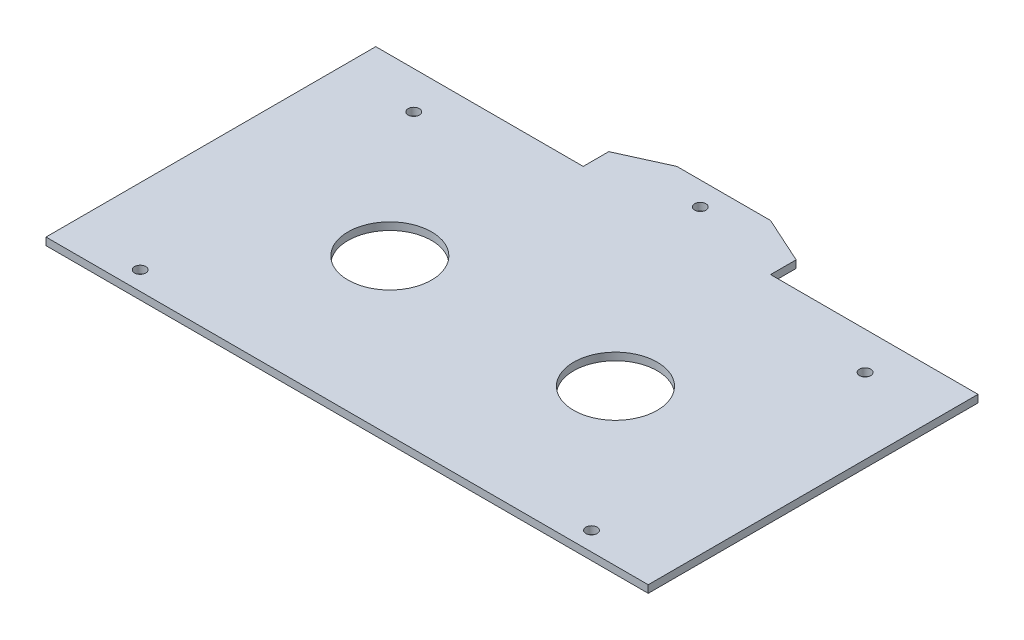
ISO-10303-21;
HEADER;
FILE_DESCRIPTION(('STEP AP214'),'2;1');
FILE_NAME('part.step','',(''),(''),'','','');
FILE_SCHEMA(('AUTOMOTIVE_DESIGN { 1 0 10303 214 1 1 1 1 }'));
ENDSEC;
DATA;
#1=APPLICATION_CONTEXT('core data for automotive mechanical design processes');
#2=APPLICATION_PROTOCOL_DEFINITION('international standard','automotive_design',2000,#1);
#3=PRODUCT_CONTEXT('',#1,'mechanical');
#4=PRODUCT('Part','Part','',(#3));
#5=PRODUCT_RELATED_PRODUCT_CATEGORY('part','',(#4));
#6=PRODUCT_DEFINITION_FORMATION('','',#4);
#7=PRODUCT_DEFINITION_CONTEXT('part definition',#1,'design');
#8=PRODUCT_DEFINITION('design','',#6,#7);
#9=PRODUCT_DEFINITION_SHAPE('','',#8);
#10=(LENGTH_UNIT() NAMED_UNIT(*) SI_UNIT(.MILLI.,.METRE.));
#11=(NAMED_UNIT(*) PLANE_ANGLE_UNIT() SI_UNIT($,.RADIAN.));
#12=(NAMED_UNIT(*) SI_UNIT($,.STERADIAN.) SOLID_ANGLE_UNIT());
#13=UNCERTAINTY_MEASURE_WITH_UNIT(LENGTH_MEASURE(1.E-05),#10,'distance_accuracy_value','');
#14=(GEOMETRIC_REPRESENTATION_CONTEXT(3) GLOBAL_UNCERTAINTY_ASSIGNED_CONTEXT((#13)) GLOBAL_UNIT_ASSIGNED_CONTEXT((#10,
#11,#12)) REPRESENTATION_CONTEXT('',''));
#15=CARTESIAN_POINT('',(0.,0.,0.));
#16=DIRECTION('',(0.,0.,1.));
#17=DIRECTION('',(1.,0.,0.));
#18=AXIS2_PLACEMENT_3D('',#15,#16,#17);
#19=CARTESIAN_POINT('',(0.,2.,-44.));
#20=DIRECTION('',(0.,0.,1.));
#21=DIRECTION('',(1.,0.,0.));
#22=AXIS2_PLACEMENT_3D('',#19,#20,#21);
#23=PLANE('',#22);
#24=DIRECTION('',(0.,1.,0.));
#25=VECTOR('',#24,1.);
#26=CARTESIAN_POINT('',(-79.1797078460986,-64.4999999999999,-44.));
#27=LINE('',#26,#25);
#28=CARTESIAN_POINT('',(-79.1797078460986,0.,-44.));
#29=VERTEX_POINT('',#28);
#30=CARTESIAN_POINT('',(-79.1797078460986,2.,-44.));
#31=VERTEX_POINT('',#30);
#32=EDGE_CURVE('E59',#29,#31,#27,.T.);
#33=ORIENTED_EDGE('',*,*,#32,.T.);
#34=DIRECTION('',(-1.,0.,0.));
#35=VECTOR('',#34,1.);
#36=CARTESIAN_POINT('',(0.,2.,-44.));
#37=LINE('',#36,#35);
#38=CARTESIAN_POINT('',(-23.8283042472908,2.,-44.));
#39=VERTEX_POINT('',#38);
#40=EDGE_CURVE('E141',#39,#31,#37,.T.);
#41=ORIENTED_EDGE('',*,*,#40,.F.);
#42=DIRECTION('',(0.,1.,0.));
#43=VECTOR('',#42,1.);
#44=CARTESIAN_POINT('',(-23.8283042472908,-51.5375899441171,-44.));
#45=LINE('',#44,#43);
#46=CARTESIAN_POINT('',(-23.8283042472908,0.,-44.));
#47=VERTEX_POINT('',#46);
#48=EDGE_CURVE('E207',#47,#39,#45,.T.);
#49=ORIENTED_EDGE('',*,*,#48,.F.);
#50=DIRECTION('',(-1.,0.,0.));
#51=VECTOR('',#50,1.);
#52=CARTESIAN_POINT('',(0.,0.,-44.));
#53=LINE('',#52,#51);
#54=EDGE_CURVE('E165',#47,#29,#53,.T.);
#55=ORIENTED_EDGE('',*,*,#54,.T.);
#56=EDGE_LOOP('',(#33,#41,#49,#55));
#57=FACE_BOUND('',#56,.T.);
#58=ADVANCED_FACE('F44',(#57),#23,.F.);
#59=CARTESIAN_POINT('',(0.,2.,44.));
#60=DIRECTION('',(0.,0.,-1.));
#61=DIRECTION('',(-1.,0.,0.));
#62=AXIS2_PLACEMENT_3D('',#59,#60,#61);
#63=PLANE('',#62);
#64=DIRECTION('',(1.,0.,0.));
#65=VECTOR('',#64,1.);
#66=CARTESIAN_POINT('',(0.,0.,44.));
#67=LINE('',#66,#65);
#68=CARTESIAN_POINT('',(-79.1797078460986,0.,44.));
#69=VERTEX_POINT('',#68);
#70=CARTESIAN_POINT('',(81.523099351517,0.,44.));
#71=VERTEX_POINT('',#70);
#72=EDGE_CURVE('E164',#69,#71,#67,.T.);
#73=ORIENTED_EDGE('',*,*,#72,.T.);
#74=DIRECTION('',(0.,1.,0.));
#75=VECTOR('',#74,1.);
#76=CARTESIAN_POINT('',(81.523099351517,-64.4999999999999,44.));
#77=LINE('',#76,#75);
#78=CARTESIAN_POINT('',(81.523099351517,2.,44.));
#79=VERTEX_POINT('',#78);
#80=EDGE_CURVE('E67',#71,#79,#77,.T.);
#81=ORIENTED_EDGE('',*,*,#80,.T.);
#82=DIRECTION('',(1.,0.,0.));
#83=VECTOR('',#82,1.);
#84=CARTESIAN_POINT('',(0.,2.,44.));
#85=LINE('',#84,#83);
#86=CARTESIAN_POINT('',(-79.1797078460986,2.,44.));
#87=VERTEX_POINT('',#86);
#88=EDGE_CURVE('E135',#87,#79,#85,.T.);
#89=ORIENTED_EDGE('',*,*,#88,.F.);
#90=DIRECTION('',(0.,1.,0.));
#91=VECTOR('',#90,1.);
#92=CARTESIAN_POINT('',(-79.1797078460986,-64.4999999999999,44.));
#93=LINE('',#92,#91);
#94=EDGE_CURVE('E136',#69,#87,#93,.T.);
#95=ORIENTED_EDGE('',*,*,#94,.F.);
#96=EDGE_LOOP('',(#73,#81,#89,#95));
#97=FACE_BOUND('',#96,.T.);
#98=ADVANCED_FACE('F192',(#97),#63,.F.);
#99=CARTESIAN_POINT('',(0.,2.,0.));
#100=DIRECTION('',(0.,1.,0.));
#101=DIRECTION('',(0.,0.,1.));
#102=AXIS2_PLACEMENT_3D('',#99,#100,#101);
#103=PLANE('',#102);
#104=DIRECTION('',(0.,0.,1.));
#105=VECTOR('',#104,1.);
#106=CARTESIAN_POINT('',(81.523099351517,2.,0.));
#107=LINE('',#106,#105);
#108=CARTESIAN_POINT('',(81.523099351517,2.,-44.));
#109=VERTEX_POINT('',#108);
#110=EDGE_CURVE('E121',#109,#79,#107,.T.);
#111=ORIENTED_EDGE('',*,*,#110,.F.);
#112=CARTESIAN_POINT('',(26.1716957527092,2.,-44.));
#113=VERTEX_POINT('',#112);
#114=EDGE_CURVE('E131',#109,#113,#37,.T.);
#115=ORIENTED_EDGE('',*,*,#114,.T.);
#116=DIRECTION('',(0.,0.,-1.));
#117=VECTOR('',#116,1.);
#118=CARTESIAN_POINT('',(26.1716957527092,2.,-44.));
#119=LINE('',#118,#117);
#120=CARTESIAN_POINT('',(26.1716957527092,2.,-50.823606938333));
#121=VERTEX_POINT('',#120);
#122=EDGE_CURVE('E205',#113,#121,#119,.T.);
#123=ORIENTED_EDGE('',*,*,#122,.T.);
#124=DIRECTION('',(-0.910654396943774,0.,-0.413168935578379));
#125=VECTOR('',#124,1.);
#126=CARTESIAN_POINT('',(26.1716957527092,2.,-50.823606938333));
#127=LINE('',#126,#125);
#128=CARTESIAN_POINT('',(13.6716957527092,2.,-56.4949260601234));
#129=VERTEX_POINT('',#128);
#130=EDGE_CURVE('E252',#121,#129,#127,.T.);
#131=ORIENTED_EDGE('',*,*,#130,.T.);
#132=DIRECTION('',(-1.,0.,0.));
#133=VECTOR('',#132,1.);
#134=CARTESIAN_POINT('',(13.6716957527092,2.,-56.4949260601234));
#135=LINE('',#134,#133);
#136=CARTESIAN_POINT('',(-11.3283042472908,2.,-56.4949260601235));
#137=VERTEX_POINT('',#136);
#138=EDGE_CURVE('E259',#129,#137,#135,.T.);
#139=ORIENTED_EDGE('',*,*,#138,.T.);
#140=DIRECTION('',(-0.910654396943774,0.,0.413168935578379));
#141=VECTOR('',#140,1.);
#142=CARTESIAN_POINT('',(-11.3283042472908,2.,-56.4949260601235));
#143=LINE('',#142,#141);
#144=CARTESIAN_POINT('',(-23.8283042472908,2.,-50.823606938333));
#145=VERTEX_POINT('',#144);
#146=EDGE_CURVE('E261',#137,#145,#143,.T.);
#147=ORIENTED_EDGE('',*,*,#146,.T.);
#148=DIRECTION('',(0.,0.,1.));
#149=VECTOR('',#148,1.);
#150=CARTESIAN_POINT('',(-23.8283042472908,2.,-50.823606938333));
#151=LINE('',#150,#149);
#152=EDGE_CURVE('E215',#145,#39,#151,.T.);
#153=ORIENTED_EDGE('',*,*,#152,.T.);
#154=ORIENTED_EDGE('',*,*,#40,.T.);
#155=DIRECTION('',(0.,0.,1.));
#156=VECTOR('',#155,1.);
#157=CARTESIAN_POINT('',(-79.1797078460986,2.,0.));
#158=LINE('',#157,#156);
#159=EDGE_CURVE('E279',#31,#87,#158,.T.);
#160=ORIENTED_EDGE('',*,*,#159,.T.);
#161=ORIENTED_EDGE('',*,*,#88,.T.);
#162=EDGE_LOOP('',(#111,#115,#123,#131,#139,#147,#153,#154,#160,#161));
#163=FACE_BOUND('',#162,.T.);
#164=CARTESIAN_POINT('',(-28.9351848900761,2.,2.5));
#165=DIRECTION('',(0.,1.,0.));
#166=DIRECTION('',(0.,0.,1.));
#167=AXIS2_PLACEMENT_3D('',#164,#165,#166);
#168=CIRCLE('',#167,11.15);
#169=CARTESIAN_POINT('',(-28.9351848900761,2.,13.65));
#170=VERTEX_POINT('',#169);
#171=EDGE_CURVE('E183',#170,#170,#168,.T.);
#172=ORIENTED_EDGE('',*,*,#171,.F.);
#173=EDGE_LOOP('',(#172));
#174=FACE_BOUND('',#173,.T.);
#175=CARTESIAN_POINT('',(31.2785763954945,2.,2.5));
#176=DIRECTION('',(0.,1.,0.));
#177=DIRECTION('',(0.,0.,1.));
#178=AXIS2_PLACEMENT_3D('',#175,#176,#177);
#179=CIRCLE('',#178,11.15);
#180=CARTESIAN_POINT('',(31.2785763954945,2.,13.65));
#181=VERTEX_POINT('',#180);
#182=EDGE_CURVE('E148',#181,#181,#179,.T.);
#183=ORIENTED_EDGE('',*,*,#182,.F.);
#184=EDGE_LOOP('',(#183));
#185=FACE_BOUND('',#184,.T.);
#186=CARTESIAN_POINT('',(61.3854570382798,2.,39.));
#187=DIRECTION('',(0.,1.,0.));
#188=DIRECTION('',(0.,0.,1.));
#189=AXIS2_PLACEMENT_3D('',#186,#187,#188);
#190=CIRCLE('',#189,1.5);
#191=CARTESIAN_POINT('',(61.3854570382798,2.,40.5));
#192=VERTEX_POINT('',#191);
#193=EDGE_CURVE('E143',#192,#192,#190,.T.);
#194=ORIENTED_EDGE('',*,*,#193,.F.);
#195=EDGE_LOOP('',(#194));
#196=FACE_BOUND('',#195,.T.);
#197=CARTESIAN_POINT('',(-59.0420655328614,2.,39.));
#198=DIRECTION('',(0.,1.,0.));
#199=DIRECTION('',(0.,0.,1.));
#200=AXIS2_PLACEMENT_3D('',#197,#198,#199);
#201=CIRCLE('',#200,1.5);
#202=CARTESIAN_POINT('',(-59.0420655328614,2.,40.5));
#203=VERTEX_POINT('',#202);
#204=EDGE_CURVE('E153',#203,#203,#201,.T.);
#205=ORIENTED_EDGE('',*,*,#204,.F.);
#206=EDGE_LOOP('',(#205));
#207=FACE_BOUND('',#206,.T.);
#208=CARTESIAN_POINT('',(-59.0420655328614,2.,-34.));
#209=DIRECTION('',(0.,1.,0.));
#210=DIRECTION('',(0.,0.,1.));
#211=AXIS2_PLACEMENT_3D('',#208,#209,#210);
#212=CIRCLE('',#211,1.5);
#213=CARTESIAN_POINT('',(-59.0420655328614,2.,-32.5));
#214=VERTEX_POINT('',#213);
#215=EDGE_CURVE('E156',#214,#214,#212,.T.);
#216=ORIENTED_EDGE('',*,*,#215,.F.);
#217=EDGE_LOOP('',(#216));
#218=FACE_BOUND('',#217,.T.);
#219=CARTESIAN_POINT('',(61.3854570382798,2.,-34.));
#220=DIRECTION('',(0.,1.,0.));
#221=DIRECTION('',(0.,0.,1.));
#222=AXIS2_PLACEMENT_3D('',#219,#220,#221);
#223=CIRCLE('',#222,1.5);
#224=CARTESIAN_POINT('',(61.3854570382798,2.,-32.5));
#225=VERTEX_POINT('',#224);
#226=EDGE_CURVE('E159',#225,#225,#223,.T.);
#227=ORIENTED_EDGE('',*,*,#226,.F.);
#228=EDGE_LOOP('',(#227));
#229=FACE_BOUND('',#228,.T.);
#230=CARTESIAN_POINT('',(1.17169575270919,2.,-50.2474630300617));
#231=DIRECTION('',(0.,1.,0.));
#232=DIRECTION('',(0.,0.,1.));
#233=AXIS2_PLACEMENT_3D('',#230,#231,#232);
#234=CIRCLE('',#233,1.5);
#235=CARTESIAN_POINT('',(1.17169575270919,2.,-48.7474630300617));
#236=VERTEX_POINT('',#235);
#237=EDGE_CURVE('E249',#236,#236,#234,.T.);
#238=ORIENTED_EDGE('',*,*,#237,.F.);
#239=EDGE_LOOP('',(#238));
#240=FACE_BOUND('',#239,.T.);
#241=ADVANCED_FACE('F128',(#163,#174,#185,#196,#207,#218,#229,#240),#103,.T.);
#242=CARTESIAN_POINT('',(0.,0.,0.));
#243=DIRECTION('',(0.,1.,0.));
#244=DIRECTION('',(0.,0.,1.));
#245=AXIS2_PLACEMENT_3D('',#242,#243,#244);
#246=PLANE('',#245);
#247=CARTESIAN_POINT('',(1.17169575270919,0.,-50.2474630300617));
#248=DIRECTION('',(0.,1.,0.));
#249=DIRECTION('',(0.,0.,1.));
#250=AXIS2_PLACEMENT_3D('',#247,#248,#249);
#251=CIRCLE('',#250,1.5);
#252=CARTESIAN_POINT('',(1.17169575270919,0.,-48.7474630300617));
#253=VERTEX_POINT('',#252);
#254=EDGE_CURVE('E225',#253,#253,#251,.F.);
#255=ORIENTED_EDGE('',*,*,#254,.F.);
#256=EDGE_LOOP('',(#255));
#257=FACE_BOUND('',#256,.T.);
#258=CARTESIAN_POINT('',(61.3854570382798,0.,-34.));
#259=DIRECTION('',(0.,1.,0.));
#260=DIRECTION('',(0.,0.,1.));
#261=AXIS2_PLACEMENT_3D('',#258,#259,#260);
#262=CIRCLE('',#261,1.5);
#263=CARTESIAN_POINT('',(61.3854570382798,0.,-32.5));
#264=VERTEX_POINT('',#263);
#265=EDGE_CURVE('E146',#264,#264,#262,.T.);
#266=ORIENTED_EDGE('',*,*,#265,.T.);
#267=EDGE_LOOP('',(#266));
#268=FACE_BOUND('',#267,.T.);
#269=CARTESIAN_POINT('',(-59.0420655328614,0.,-34.));
#270=DIRECTION('',(0.,1.,0.));
#271=DIRECTION('',(0.,0.,1.));
#272=AXIS2_PLACEMENT_3D('',#269,#270,#271);
#273=CIRCLE('',#272,1.5);
#274=CARTESIAN_POINT('',(-59.0420655328614,0.,-32.5));
#275=VERTEX_POINT('',#274);
#276=EDGE_CURVE('E174',#275,#275,#273,.T.);
#277=ORIENTED_EDGE('',*,*,#276,.T.);
#278=EDGE_LOOP('',(#277));
#279=FACE_BOUND('',#278,.T.);
#280=CARTESIAN_POINT('',(-59.0420655328614,0.,39.));
#281=DIRECTION('',(0.,1.,0.));
#282=DIRECTION('',(0.,0.,1.));
#283=AXIS2_PLACEMENT_3D('',#280,#281,#282);
#284=CIRCLE('',#283,1.5);
#285=CARTESIAN_POINT('',(-59.0420655328614,0.,40.5));
#286=VERTEX_POINT('',#285);
#287=EDGE_CURVE('E171',#286,#286,#284,.T.);
#288=ORIENTED_EDGE('',*,*,#287,.T.);
#289=EDGE_LOOP('',(#288));
#290=FACE_BOUND('',#289,.T.);
#291=CARTESIAN_POINT('',(61.3854570382798,0.,39.));
#292=DIRECTION('',(0.,1.,0.));
#293=DIRECTION('',(0.,0.,1.));
#294=AXIS2_PLACEMENT_3D('',#291,#292,#293);
#295=CIRCLE('',#294,1.5);
#296=CARTESIAN_POINT('',(61.3854570382798,0.,40.5));
#297=VERTEX_POINT('',#296);
#298=EDGE_CURVE('E168',#297,#297,#295,.T.);
#299=ORIENTED_EDGE('',*,*,#298,.T.);
#300=EDGE_LOOP('',(#299));
#301=FACE_BOUND('',#300,.T.);
#302=CARTESIAN_POINT('',(31.2785763954945,0.,2.5));
#303=DIRECTION('',(0.,1.,0.));
#304=DIRECTION('',(0.,0.,1.));
#305=AXIS2_PLACEMENT_3D('',#302,#303,#304);
#306=CIRCLE('',#305,11.15);
#307=CARTESIAN_POINT('',(31.2785763954945,0.,13.65));
#308=VERTEX_POINT('',#307);
#309=EDGE_CURVE('E179',#308,#308,#306,.T.);
#310=ORIENTED_EDGE('',*,*,#309,.T.);
#311=EDGE_LOOP('',(#310));
#312=FACE_BOUND('',#311,.T.);
#313=CARTESIAN_POINT('',(-28.9351848900761,0.,2.5));
#314=DIRECTION('',(0.,1.,0.));
#315=DIRECTION('',(0.,0.,1.));
#316=AXIS2_PLACEMENT_3D('',#313,#314,#315);
#317=CIRCLE('',#316,11.15);
#318=CARTESIAN_POINT('',(-28.9351848900761,0.,13.65));
#319=VERTEX_POINT('',#318);
#320=EDGE_CURVE('E182',#319,#319,#317,.T.);
#321=ORIENTED_EDGE('',*,*,#320,.T.);
#322=EDGE_LOOP('',(#321));
#323=FACE_BOUND('',#322,.T.);
#324=CARTESIAN_POINT('',(81.523099351517,0.,-44.));
#325=VERTEX_POINT('',#324);
#326=CARTESIAN_POINT('',(26.1716957527092,0.,-44.));
#327=VERTEX_POINT('',#326);
#328=EDGE_CURVE('E162',#325,#327,#53,.T.);
#329=ORIENTED_EDGE('',*,*,#328,.F.);
#330=DIRECTION('',(0.,0.,1.));
#331=VECTOR('',#330,1.);
#332=CARTESIAN_POINT('',(81.523099351517,0.,0.));
#333=LINE('',#332,#331);
#334=EDGE_CURVE('E11',#325,#71,#333,.T.);
#335=ORIENTED_EDGE('',*,*,#334,.T.);
#336=ORIENTED_EDGE('',*,*,#72,.F.);
#337=DIRECTION('',(0.,0.,1.));
#338=VECTOR('',#337,1.);
#339=CARTESIAN_POINT('',(-79.1797078460986,0.,0.));
#340=LINE('',#339,#338);
#341=EDGE_CURVE('E52',#29,#69,#340,.T.);
#342=ORIENTED_EDGE('',*,*,#341,.F.);
#343=ORIENTED_EDGE('',*,*,#54,.F.);
#344=DIRECTION('',(0.,0.,-1.));
#345=VECTOR('',#344,1.);
#346=CARTESIAN_POINT('',(-23.8283042472908,0.,-50.823606938333));
#347=LINE('',#346,#345);
#348=CARTESIAN_POINT('',(-23.8283042472908,0.,-50.823606938333));
#349=VERTEX_POINT('',#348);
#350=EDGE_CURVE('E202',#47,#349,#347,.T.);
#351=ORIENTED_EDGE('',*,*,#350,.T.);
#352=DIRECTION('',(0.910654396943774,0.,-0.413168935578379));
#353=VECTOR('',#352,1.);
#354=CARTESIAN_POINT('',(-11.3283042472908,0.,-56.4949260601235));
#355=LINE('',#354,#353);
#356=CARTESIAN_POINT('',(-11.3283042472908,0.,-56.4949260601235));
#357=VERTEX_POINT('',#356);
#358=EDGE_CURVE('E209',#349,#357,#355,.T.);
#359=ORIENTED_EDGE('',*,*,#358,.T.);
#360=DIRECTION('',(1.,0.,0.));
#361=VECTOR('',#360,1.);
#362=CARTESIAN_POINT('',(13.6716957527092,0.,-56.4949260601234));
#363=LINE('',#362,#361);
#364=CARTESIAN_POINT('',(13.6716957527092,0.,-56.4949260601234));
#365=VERTEX_POINT('',#364);
#366=EDGE_CURVE('E206',#357,#365,#363,.T.);
#367=ORIENTED_EDGE('',*,*,#366,.T.);
#368=DIRECTION('',(0.910654396943774,0.,0.413168935578379));
#369=VECTOR('',#368,1.);
#370=CARTESIAN_POINT('',(26.1716957527092,0.,-50.823606938333));
#371=LINE('',#370,#369);
#372=CARTESIAN_POINT('',(26.1716957527092,0.,-50.823606938333));
#373=VERTEX_POINT('',#372);
#374=EDGE_CURVE('E199',#365,#373,#371,.T.);
#375=ORIENTED_EDGE('',*,*,#374,.T.);
#376=DIRECTION('',(0.,0.,1.));
#377=VECTOR('',#376,1.);
#378=CARTESIAN_POINT('',(26.1716957527092,0.,-44.));
#379=LINE('',#378,#377);
#380=EDGE_CURVE('E197',#373,#327,#379,.T.);
#381=ORIENTED_EDGE('',*,*,#380,.T.);
#382=EDGE_LOOP('',(#329,#335,#336,#342,#343,#351,#359,#367,#375,#381));
#383=FACE_BOUND('',#382,.T.);
#384=ADVANCED_FACE('F194',(#257,#268,#279,#290,#301,#312,#323,#383),#246,.F.);
#385=ORIENTED_EDGE('',*,*,#114,.F.);
#386=DIRECTION('',(0.,1.,0.));
#387=VECTOR('',#386,1.);
#388=CARTESIAN_POINT('',(81.523099351517,-64.4999999999999,-44.));
#389=LINE('',#388,#387);
#390=EDGE_CURVE('E118',#325,#109,#389,.T.);
#391=ORIENTED_EDGE('',*,*,#390,.F.);
#392=ORIENTED_EDGE('',*,*,#328,.T.);
#393=DIRECTION('',(0.,1.,0.));
#394=VECTOR('',#393,1.);
#395=CARTESIAN_POINT('',(26.1716957527092,-51.5375899441171,-44.));
#396=LINE('',#395,#394);
#397=EDGE_CURVE('E139',#327,#113,#396,.T.);
#398=ORIENTED_EDGE('',*,*,#397,.T.);
#399=EDGE_LOOP('',(#385,#391,#392,#398));
#400=FACE_BOUND('',#399,.T.);
#401=ADVANCED_FACE('F46',(#400),#23,.F.);
#402=CARTESIAN_POINT('',(-59.0420655328614,2.,-34.));
#403=DIRECTION('',(0.,-1.,0.));
#404=DIRECTION('',(0.,0.,-1.));
#405=AXIS2_PLACEMENT_3D('',#402,#403,#404);
#406=CYLINDRICAL_SURFACE('',#405,1.5);
#407=ORIENTED_EDGE('',*,*,#215,.T.);
#408=EDGE_LOOP('',(#407));
#409=FACE_BOUND('',#408,.T.);
#410=ORIENTED_EDGE('',*,*,#276,.F.);
#411=EDGE_LOOP('',(#410));
#412=FACE_BOUND('',#411,.T.);
#413=ADVANCED_FACE('F303',(#409,#412),#406,.F.);
#414=CARTESIAN_POINT('',(-59.0420655328614,2.,39.));
#415=DIRECTION('',(0.,-1.,0.));
#416=DIRECTION('',(0.,0.,-1.));
#417=AXIS2_PLACEMENT_3D('',#414,#415,#416);
#418=CYLINDRICAL_SURFACE('',#417,1.5);
#419=ORIENTED_EDGE('',*,*,#204,.T.);
#420=EDGE_LOOP('',(#419));
#421=FACE_BOUND('',#420,.T.);
#422=ORIENTED_EDGE('',*,*,#287,.F.);
#423=EDGE_LOOP('',(#422));
#424=FACE_BOUND('',#423,.T.);
#425=ADVANCED_FACE('F308',(#421,#424),#418,.F.);
#426=CARTESIAN_POINT('',(61.3854570382798,2.,39.));
#427=DIRECTION('',(0.,-1.,0.));
#428=DIRECTION('',(0.,0.,-1.));
#429=AXIS2_PLACEMENT_3D('',#426,#427,#428);
#430=CYLINDRICAL_SURFACE('',#429,1.5);
#431=ORIENTED_EDGE('',*,*,#193,.T.);
#432=EDGE_LOOP('',(#431));
#433=FACE_BOUND('',#432,.T.);
#434=ORIENTED_EDGE('',*,*,#298,.F.);
#435=EDGE_LOOP('',(#434));
#436=FACE_BOUND('',#435,.T.);
#437=ADVANCED_FACE('F321',(#433,#436),#430,.F.);
#438=CARTESIAN_POINT('',(61.3854570382798,2.,-34.));
#439=DIRECTION('',(0.,-1.,0.));
#440=DIRECTION('',(0.,0.,-1.));
#441=AXIS2_PLACEMENT_3D('',#438,#439,#440);
#442=CYLINDRICAL_SURFACE('',#441,1.5);
#443=ORIENTED_EDGE('',*,*,#226,.T.);
#444=EDGE_LOOP('',(#443));
#445=FACE_BOUND('',#444,.T.);
#446=ORIENTED_EDGE('',*,*,#265,.F.);
#447=EDGE_LOOP('',(#446));
#448=FACE_BOUND('',#447,.T.);
#449=ADVANCED_FACE('F319',(#445,#448),#442,.F.);
#450=CARTESIAN_POINT('',(31.2785763954945,-8.,2.5));
#451=DIRECTION('',(0.,1.,0.));
#452=DIRECTION('',(0.,0.,1.));
#453=AXIS2_PLACEMENT_3D('',#450,#451,#452);
#454=CYLINDRICAL_SURFACE('',#453,11.15);
#455=ORIENTED_EDGE('',*,*,#182,.T.);
#456=EDGE_LOOP('',(#455));
#457=FACE_BOUND('',#456,.T.);
#458=ORIENTED_EDGE('',*,*,#309,.F.);
#459=EDGE_LOOP('',(#458));
#460=FACE_BOUND('',#459,.T.);
#461=ADVANCED_FACE('F233',(#457,#460),#454,.F.);
#462=CARTESIAN_POINT('',(-28.9351848900761,-8.,2.5));
#463=DIRECTION('',(0.,1.,0.));
#464=DIRECTION('',(0.,0.,1.));
#465=AXIS2_PLACEMENT_3D('',#462,#463,#464);
#466=CYLINDRICAL_SURFACE('',#465,11.15);
#467=ORIENTED_EDGE('',*,*,#171,.T.);
#468=EDGE_LOOP('',(#467));
#469=FACE_BOUND('',#468,.T.);
#470=ORIENTED_EDGE('',*,*,#320,.F.);
#471=EDGE_LOOP('',(#470));
#472=FACE_BOUND('',#471,.T.);
#473=ADVANCED_FACE('F289',(#469,#472),#466,.F.);
#474=CARTESIAN_POINT('',(26.1716957527092,-51.5375899441171,-50.823606938333));
#475=DIRECTION('',(0.413168935578379,0.,-0.910654396943774));
#476=DIRECTION('',(-0.910654396943774,0.,-0.413168935578379));
#477=AXIS2_PLACEMENT_3D('',#474,#475,#476);
#478=PLANE('',#477);
#479=ORIENTED_EDGE('',*,*,#374,.F.);
#480=DIRECTION('',(0.,1.,0.));
#481=VECTOR('',#480,1.);
#482=CARTESIAN_POINT('',(13.6716957527092,-51.5375899441171,-56.4949260601234));
#483=LINE('',#482,#481);
#484=EDGE_CURVE('E221',#365,#129,#483,.T.);
#485=ORIENTED_EDGE('',*,*,#484,.T.);
#486=ORIENTED_EDGE('',*,*,#130,.F.);
#487=DIRECTION('',(0.,1.,0.));
#488=VECTOR('',#487,1.);
#489=CARTESIAN_POINT('',(26.1716957527092,-51.5375899441171,-50.823606938333));
#490=LINE('',#489,#488);
#491=EDGE_CURVE('E223',#373,#121,#490,.T.);
#492=ORIENTED_EDGE('',*,*,#491,.F.);
#493=EDGE_LOOP('',(#479,#485,#486,#492));
#494=FACE_BOUND('',#493,.T.);
#495=ADVANCED_FACE('F287',(#494),#478,.T.);
#496=CARTESIAN_POINT('',(13.6716957527092,-51.5375899441171,-56.4949260601234));
#497=DIRECTION('',(0.,0.,-1.));
#498=DIRECTION('',(-1.,0.,0.));
#499=AXIS2_PLACEMENT_3D('',#496,#497,#498);
#500=PLANE('',#499);
#501=ORIENTED_EDGE('',*,*,#366,.F.);
#502=DIRECTION('',(0.,1.,0.));
#503=VECTOR('',#502,1.);
#504=CARTESIAN_POINT('',(-11.3283042472908,-51.5375899441171,-56.4949260601235));
#505=LINE('',#504,#503);
#506=EDGE_CURVE('E219',#357,#137,#505,.T.);
#507=ORIENTED_EDGE('',*,*,#506,.T.);
#508=ORIENTED_EDGE('',*,*,#138,.F.);
#509=ORIENTED_EDGE('',*,*,#484,.F.);
#510=EDGE_LOOP('',(#501,#507,#508,#509));
#511=FACE_BOUND('',#510,.T.);
#512=ADVANCED_FACE('F283',(#511),#500,.T.);
#513=CARTESIAN_POINT('',(-11.3283042472908,-51.5375899441171,-56.4949260601235));
#514=DIRECTION('',(-0.413168935578379,0.,-0.910654396943774));
#515=DIRECTION('',(-0.910654396943774,0.,0.413168935578379));
#516=AXIS2_PLACEMENT_3D('',#513,#514,#515);
#517=PLANE('',#516);
#518=ORIENTED_EDGE('',*,*,#358,.F.);
#519=DIRECTION('',(0.,1.,0.));
#520=VECTOR('',#519,1.);
#521=CARTESIAN_POINT('',(-23.8283042472908,-51.5375899441171,-50.823606938333));
#522=LINE('',#521,#520);
#523=EDGE_CURVE('E212',#349,#145,#522,.T.);
#524=ORIENTED_EDGE('',*,*,#523,.T.);
#525=ORIENTED_EDGE('',*,*,#146,.F.);
#526=ORIENTED_EDGE('',*,*,#506,.F.);
#527=EDGE_LOOP('',(#518,#524,#525,#526));
#528=FACE_BOUND('',#527,.T.);
#529=ADVANCED_FACE('F275',(#528),#517,.T.);
#530=CARTESIAN_POINT('',(-23.8283042472908,-51.5375899441171,-50.823606938333));
#531=DIRECTION('',(-1.,0.,0.));
#532=DIRECTION('',(0.,0.,1.));
#533=AXIS2_PLACEMENT_3D('',#530,#531,#532);
#534=PLANE('',#533);
#535=ORIENTED_EDGE('',*,*,#350,.F.);
#536=ORIENTED_EDGE('',*,*,#48,.T.);
#537=ORIENTED_EDGE('',*,*,#152,.F.);
#538=ORIENTED_EDGE('',*,*,#523,.F.);
#539=EDGE_LOOP('',(#535,#536,#537,#538));
#540=FACE_BOUND('',#539,.T.);
#541=ADVANCED_FACE('F269',(#540),#534,.T.);
#542=CARTESIAN_POINT('',(26.1716957527092,-51.5375899441171,-44.));
#543=DIRECTION('',(1.,0.,0.));
#544=DIRECTION('',(0.,0.,-1.));
#545=AXIS2_PLACEMENT_3D('',#542,#543,#544);
#546=PLANE('',#545);
#547=ORIENTED_EDGE('',*,*,#380,.F.);
#548=ORIENTED_EDGE('',*,*,#491,.T.);
#549=ORIENTED_EDGE('',*,*,#122,.F.);
#550=ORIENTED_EDGE('',*,*,#397,.F.);
#551=EDGE_LOOP('',(#547,#548,#549,#550));
#552=FACE_BOUND('',#551,.T.);
#553=ADVANCED_FACE('F204',(#552),#546,.T.);
#554=CARTESIAN_POINT('',(1.17169575270919,-51.5375899441171,-50.2474630300617));
#555=DIRECTION('',(0.,1.,0.));
#556=DIRECTION('',(0.,0.,1.));
#557=AXIS2_PLACEMENT_3D('',#554,#555,#556);
#558=CYLINDRICAL_SURFACE('',#557,1.5);
#559=ORIENTED_EDGE('',*,*,#254,.T.);
#560=EDGE_LOOP('',(#559));
#561=FACE_BOUND('',#560,.T.);
#562=ORIENTED_EDGE('',*,*,#237,.T.);
#563=EDGE_LOOP('',(#562));
#564=FACE_BOUND('',#563,.T.);
#565=ADVANCED_FACE('F343',(#561,#564),#558,.F.);
#566=CARTESIAN_POINT('',(-79.1797078460986,-64.4999999999999,0.));
#567=DIRECTION('',(-1.,0.,0.));
#568=DIRECTION('',(0.,0.,1.));
#569=AXIS2_PLACEMENT_3D('',#566,#567,#568);
#570=PLANE('',#569);
#571=ORIENTED_EDGE('',*,*,#341,.T.);
#572=ORIENTED_EDGE('',*,*,#94,.T.);
#573=ORIENTED_EDGE('',*,*,#159,.F.);
#574=ORIENTED_EDGE('',*,*,#32,.F.);
#575=EDGE_LOOP('',(#571,#572,#573,#574));
#576=FACE_BOUND('',#575,.T.);
#577=ADVANCED_FACE('F186',(#576),#570,.T.);
#578=CARTESIAN_POINT('',(81.523099351517,-64.4999999999999,0.));
#579=DIRECTION('',(-1.,0.,0.));
#580=DIRECTION('',(0.,0.,1.));
#581=AXIS2_PLACEMENT_3D('',#578,#579,#580);
#582=PLANE('',#581);
#583=ORIENTED_EDGE('',*,*,#390,.T.);
#584=ORIENTED_EDGE('',*,*,#110,.T.);
#585=ORIENTED_EDGE('',*,*,#80,.F.);
#586=ORIENTED_EDGE('',*,*,#334,.F.);
#587=EDGE_LOOP('',(#583,#584,#585,#586));
#588=FACE_BOUND('',#587,.T.);
#589=ADVANCED_FACE('F120',(#588),#582,.F.);
#590=CLOSED_SHELL('',(#58,#98,#241,#384,#401,#413,#425,#437,#449,#461,#473,#495,#512,#529,#541,
#553,#565,#577,#589));
#591=MANIFOLD_SOLID_BREP('B2',#590);
#592=ADVANCED_BREP_SHAPE_REPRESENTATION('',(#18,#591),#14);
#593=SHAPE_DEFINITION_REPRESENTATION(#9,#592);
ENDSEC;
END-ISO-10303-21;
